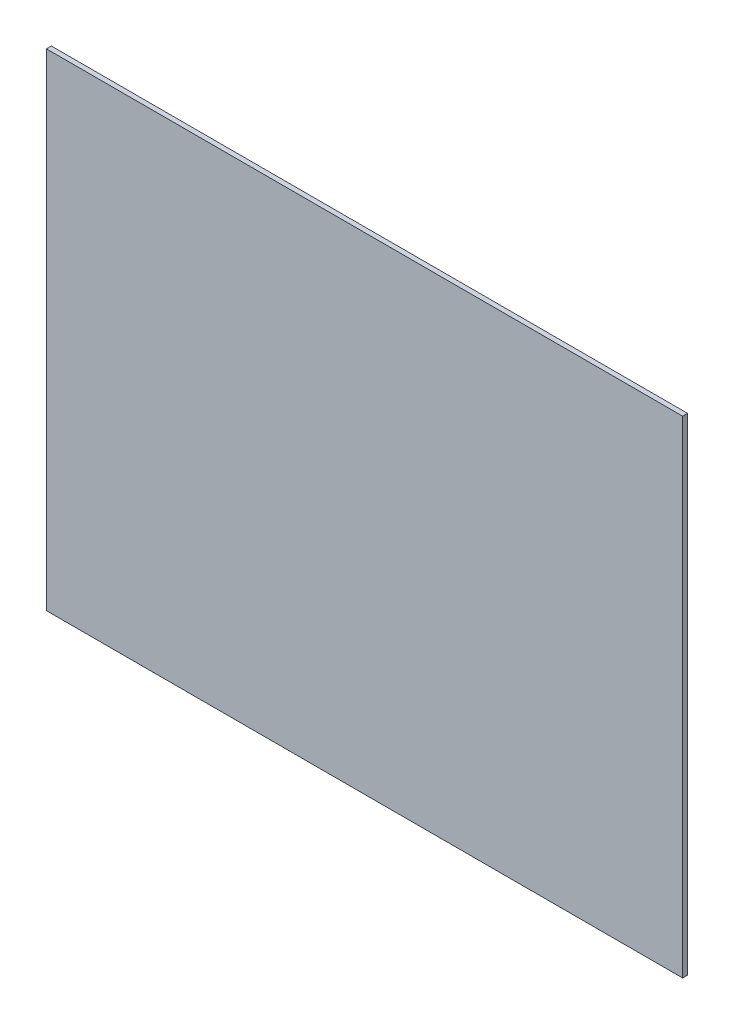
ISO-10303-21;
HEADER;
FILE_DESCRIPTION(('STEP AP214'),'2;1');
FILE_NAME('part.step','',(''),(''),'','','');
FILE_SCHEMA(('AUTOMOTIVE_DESIGN { 1 0 10303 214 1 1 1 1 }'));
ENDSEC;
DATA;
#1=APPLICATION_CONTEXT('core data for automotive mechanical design processes');
#2=APPLICATION_PROTOCOL_DEFINITION('international standard','automotive_design',2000,#1);
#3=PRODUCT_CONTEXT('',#1,'mechanical');
#4=PRODUCT('Part','Part','',(#3));
#5=PRODUCT_RELATED_PRODUCT_CATEGORY('part','',(#4));
#6=PRODUCT_DEFINITION_FORMATION('','',#4);
#7=PRODUCT_DEFINITION_CONTEXT('part definition',#1,'design');
#8=PRODUCT_DEFINITION('design','',#6,#7);
#9=PRODUCT_DEFINITION_SHAPE('','',#8);
#10=(LENGTH_UNIT() NAMED_UNIT(*) SI_UNIT(.MILLI.,.METRE.));
#11=(NAMED_UNIT(*) PLANE_ANGLE_UNIT() SI_UNIT($,.RADIAN.));
#12=(NAMED_UNIT(*) SI_UNIT($,.STERADIAN.) SOLID_ANGLE_UNIT());
#13=UNCERTAINTY_MEASURE_WITH_UNIT(LENGTH_MEASURE(1.E-05),#10,'distance_accuracy_value','');
#14=(GEOMETRIC_REPRESENTATION_CONTEXT(3) GLOBAL_UNCERTAINTY_ASSIGNED_CONTEXT((#13)) GLOBAL_UNIT_ASSIGNED_CONTEXT((#10,
#11,#12)) REPRESENTATION_CONTEXT('',''));
#15=CARTESIAN_POINT('',(0.,0.,0.));
#16=DIRECTION('',(0.,0.,1.));
#17=DIRECTION('',(1.,0.,0.));
#18=AXIS2_PLACEMENT_3D('',#15,#16,#17);
#19=CARTESIAN_POINT('',(-0.0100000000000378,107.5,-39.));
#20=DIRECTION('',(0.,0.,1.));
#21=DIRECTION('',(0.,-1.,0.));
#22=AXIS2_PLACEMENT_3D('',#19,#20,#21);
#23=PLANE('',#22);
#24=DIRECTION('',(0.,-1.,0.));
#25=VECTOR('',#24,1.);
#26=CARTESIAN_POINT('',(165.,107.5,-39.));
#27=LINE('',#26,#25);
#28=CARTESIAN_POINT('',(165.,107.5,-39.));
#29=VERTEX_POINT('',#28);
#30=CARTESIAN_POINT('',(165.,8.50000000000001,-39.));
#31=VERTEX_POINT('',#30);
#32=EDGE_CURVE('E11',#29,#31,#27,.T.);
#33=ORIENTED_EDGE('',*,*,#32,.F.);
#34=DIRECTION('',(1.,0.,0.));
#35=VECTOR('',#34,1.);
#36=CARTESIAN_POINT('',(165.,107.5,-39.));
#37=LINE('',#36,#35);
#38=CARTESIAN_POINT('',(35.5503363687331,107.5,-39.));
#39=VERTEX_POINT('',#38);
#40=EDGE_CURVE('E83',#39,#29,#37,.T.);
#41=ORIENTED_EDGE('',*,*,#40,.F.);
#42=DIRECTION('',(0.,1.,0.));
#43=VECTOR('',#42,1.);
#44=CARTESIAN_POINT('',(35.5503363687331,107.5,-39.));
#45=LINE('',#44,#43);
#46=CARTESIAN_POINT('',(35.550336368733,8.50000000000001,-39.));
#47=VERTEX_POINT('',#46);
#48=EDGE_CURVE('E79',#47,#39,#45,.T.);
#49=ORIENTED_EDGE('',*,*,#48,.F.);
#50=DIRECTION('',(-1.,0.,0.));
#51=VECTOR('',#50,1.);
#52=CARTESIAN_POINT('',(165.,8.50000000000001,-39.));
#53=LINE('',#52,#51);
#54=EDGE_CURVE('E44',#31,#47,#53,.T.);
#55=ORIENTED_EDGE('',*,*,#54,.F.);
#56=EDGE_LOOP('',(#33,#41,#49,#55));
#57=FACE_BOUND('',#56,.T.);
#58=ADVANCED_FACE('F35',(#57),#23,.T.);
#59=CARTESIAN_POINT('',(35.5503363687331,107.5,-39.));
#60=DIRECTION('',(1.,0.,0.));
#61=DIRECTION('',(0.,1.,0.));
#62=AXIS2_PLACEMENT_3D('',#59,#60,#61);
#63=PLANE('',#62);
#64=ORIENTED_EDGE('',*,*,#48,.T.);
#65=DIRECTION('',(0.,0.,1.));
#66=VECTOR('',#65,1.);
#67=CARTESIAN_POINT('',(35.5503363687331,107.5,-39.));
#68=LINE('',#67,#66);
#69=CARTESIAN_POINT('',(35.5503363687331,107.5,-40.));
#70=VERTEX_POINT('',#69);
#71=EDGE_CURVE('E91',#70,#39,#68,.T.);
#72=ORIENTED_EDGE('',*,*,#71,.F.);
#73=DIRECTION('',(0.,1.,0.));
#74=VECTOR('',#73,1.);
#75=CARTESIAN_POINT('',(35.5503363687331,107.5,-40.));
#76=LINE('',#75,#74);
#77=CARTESIAN_POINT('',(35.550336368733,8.50000000000001,-40.));
#78=VERTEX_POINT('',#77);
#79=EDGE_CURVE('E90',#78,#70,#76,.T.);
#80=ORIENTED_EDGE('',*,*,#79,.F.);
#81=DIRECTION('',(0.,0.,1.));
#82=VECTOR('',#81,1.);
#83=CARTESIAN_POINT('',(35.550336368733,8.50000000000001,-39.));
#84=LINE('',#83,#82);
#85=EDGE_CURVE('E58',#78,#47,#84,.T.);
#86=ORIENTED_EDGE('',*,*,#85,.T.);
#87=EDGE_LOOP('',(#64,#72,#80,#86));
#88=FACE_BOUND('',#87,.T.);
#89=ADVANCED_FACE('F88',(#88),#63,.F.);
#90=CARTESIAN_POINT('',(0.,0.,-40.));
#91=DIRECTION('',(0.,0.,-1.));
#92=DIRECTION('',(-1.,0.,0.));
#93=AXIS2_PLACEMENT_3D('',#90,#91,#92);
#94=PLANE('',#93);
#95=DIRECTION('',(0.,-1.,0.));
#96=VECTOR('',#95,1.);
#97=CARTESIAN_POINT('',(165.,107.5,-40.));
#98=LINE('',#97,#96);
#99=CARTESIAN_POINT('',(165.,107.5,-40.));
#100=VERTEX_POINT('',#99);
#101=CARTESIAN_POINT('',(165.,8.50000000000001,-40.));
#102=VERTEX_POINT('',#101);
#103=EDGE_CURVE('E95',#100,#102,#98,.T.);
#104=ORIENTED_EDGE('',*,*,#103,.T.);
#105=DIRECTION('',(-1.,0.,0.));
#106=VECTOR('',#105,1.);
#107=CARTESIAN_POINT('',(165.,8.50000000000001,-40.));
#108=LINE('',#107,#106);
#109=EDGE_CURVE('E98',#102,#78,#108,.T.);
#110=ORIENTED_EDGE('',*,*,#109,.T.);
#111=ORIENTED_EDGE('',*,*,#79,.T.);
#112=DIRECTION('',(1.,0.,0.));
#113=VECTOR('',#112,1.);
#114=CARTESIAN_POINT('',(165.,107.5,-40.));
#115=LINE('',#114,#113);
#116=EDGE_CURVE('E101',#70,#100,#115,.T.);
#117=ORIENTED_EDGE('',*,*,#116,.T.);
#118=EDGE_LOOP('',(#104,#110,#111,#117));
#119=FACE_BOUND('',#118,.T.);
#120=ADVANCED_FACE('F109',(#119),#94,.T.);
#121=CARTESIAN_POINT('',(165.,0.,4.));
#122=DIRECTION('',(1.,0.,0.));
#123=DIRECTION('',(0.,0.,-1.));
#124=AXIS2_PLACEMENT_3D('',#121,#122,#123);
#125=PLANE('',#124);
#126=DIRECTION('',(0.,0.,1.));
#127=VECTOR('',#126,1.);
#128=CARTESIAN_POINT('',(165.,107.5,-39.));
#129=LINE('',#128,#127);
#130=EDGE_CURVE('E39',#100,#29,#129,.T.);
#131=ORIENTED_EDGE('',*,*,#130,.T.);
#132=ORIENTED_EDGE('',*,*,#32,.T.);
#133=DIRECTION('',(0.,0.,1.));
#134=VECTOR('',#133,1.);
#135=CARTESIAN_POINT('',(165.,8.50000000000001,-39.));
#136=LINE('',#135,#134);
#137=EDGE_CURVE('E51',#102,#31,#136,.T.);
#138=ORIENTED_EDGE('',*,*,#137,.F.);
#139=ORIENTED_EDGE('',*,*,#103,.F.);
#140=EDGE_LOOP('',(#131,#132,#138,#139));
#141=FACE_BOUND('',#140,.T.);
#142=ADVANCED_FACE('F37',(#141),#125,.T.);
#143=CARTESIAN_POINT('',(35.5503363687331,107.5,-39.));
#144=DIRECTION('',(0.,-1.,0.));
#145=DIRECTION('',(0.,0.,-1.));
#146=AXIS2_PLACEMENT_3D('',#143,#144,#145);
#147=PLANE('',#146);
#148=ORIENTED_EDGE('',*,*,#40,.T.);
#149=ORIENTED_EDGE('',*,*,#130,.F.);
#150=ORIENTED_EDGE('',*,*,#116,.F.);
#151=ORIENTED_EDGE('',*,*,#71,.T.);
#152=EDGE_LOOP('',(#148,#149,#150,#151));
#153=FACE_BOUND('',#152,.T.);
#154=ADVANCED_FACE('F106',(#153),#147,.F.);
#155=CARTESIAN_POINT('',(35.550336368733,8.50000000000001,-39.));
#156=DIRECTION('',(0.,1.,0.));
#157=DIRECTION('',(0.,0.,1.));
#158=AXIS2_PLACEMENT_3D('',#155,#156,#157);
#159=PLANE('',#158);
#160=ORIENTED_EDGE('',*,*,#54,.T.);
#161=ORIENTED_EDGE('',*,*,#85,.F.);
#162=ORIENTED_EDGE('',*,*,#109,.F.);
#163=ORIENTED_EDGE('',*,*,#137,.T.);
#164=EDGE_LOOP('',(#160,#161,#162,#163));
#165=FACE_BOUND('',#164,.T.);
#166=ADVANCED_FACE('F77',(#165),#159,.F.);
#167=CLOSED_SHELL('',(#58,#89,#120,#142,#154,#166));
#168=MANIFOLD_SOLID_BREP('B2',#167);
#169=ADVANCED_BREP_SHAPE_REPRESENTATION('',(#18,#168),#14);
#170=SHAPE_DEFINITION_REPRESENTATION(#9,#169);
ENDSEC;
END-ISO-10303-21;
